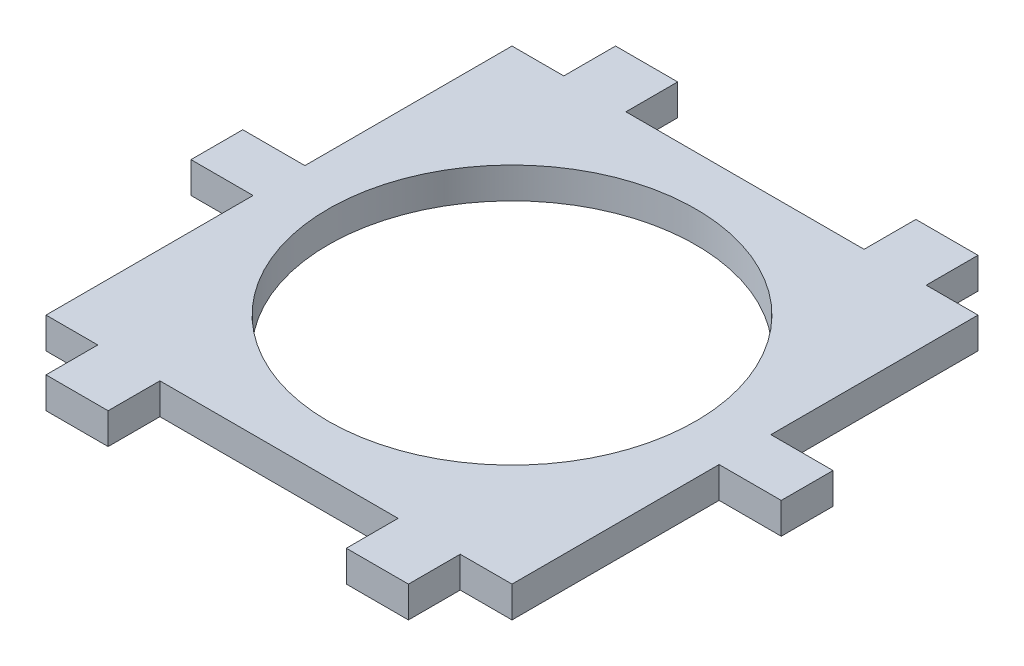
ISO-10303-21;
HEADER;
FILE_DESCRIPTION(('STEP AP214'),'2;1');
FILE_NAME('part.step','',(''),(''),'','','');
FILE_SCHEMA(('AUTOMOTIVE_DESIGN { 1 0 10303 214 1 1 1 1 }'));
ENDSEC;
DATA;
#1=APPLICATION_CONTEXT('core data for automotive mechanical design processes');
#2=APPLICATION_PROTOCOL_DEFINITION('international standard','automotive_design',2000,#1);
#3=PRODUCT_CONTEXT('',#1,'mechanical');
#4=PRODUCT('Part','Part','',(#3));
#5=PRODUCT_RELATED_PRODUCT_CATEGORY('part','',(#4));
#6=PRODUCT_DEFINITION_FORMATION('','',#4);
#7=PRODUCT_DEFINITION_CONTEXT('part definition',#1,'design');
#8=PRODUCT_DEFINITION('design','',#6,#7);
#9=PRODUCT_DEFINITION_SHAPE('','',#8);
#10=(LENGTH_UNIT() NAMED_UNIT(*) SI_UNIT(.MILLI.,.METRE.));
#11=(NAMED_UNIT(*) PLANE_ANGLE_UNIT() SI_UNIT($,.RADIAN.));
#12=(NAMED_UNIT(*) SI_UNIT($,.STERADIAN.) SOLID_ANGLE_UNIT());
#13=UNCERTAINTY_MEASURE_WITH_UNIT(LENGTH_MEASURE(1.E-05),#10,'distance_accuracy_value','');
#14=(GEOMETRIC_REPRESENTATION_CONTEXT(3) GLOBAL_UNCERTAINTY_ASSIGNED_CONTEXT((#13)) GLOBAL_UNIT_ASSIGNED_CONTEXT((#10,
#11,#12)) REPRESENTATION_CONTEXT('',''));
#15=CARTESIAN_POINT('',(0.,0.,0.));
#16=DIRECTION('',(0.,0.,1.));
#17=DIRECTION('',(1.,0.,0.));
#18=AXIS2_PLACEMENT_3D('',#15,#16,#17);
#19=CARTESIAN_POINT('',(22.5,3.,0.));
#20=DIRECTION('',(1.,0.,0.));
#21=DIRECTION('',(0.,0.,-1.));
#22=AXIS2_PLACEMENT_3D('',#19,#20,#21);
#23=PLANE('',#22);
#24=DIRECTION('',(0.,0.,1.));
#25=VECTOR('',#24,1.);
#26=CARTESIAN_POINT('',(22.5,3.,0.));
#27=LINE('',#26,#25);
#28=CARTESIAN_POINT('',(22.5,3.,-22.5));
#29=VERTEX_POINT('',#28);
#30=CARTESIAN_POINT('',(22.5,3.,-2.50000000000001));
#31=VERTEX_POINT('',#30);
#32=EDGE_CURVE('E480',#29,#31,#27,.T.);
#33=ORIENTED_EDGE('',*,*,#32,.T.);
#34=DIRECTION('',(0.,-1.,0.));
#35=VECTOR('',#34,1.);
#36=CARTESIAN_POINT('',(22.5,3.,-2.50000000000001));
#37=LINE('',#36,#35);
#38=CARTESIAN_POINT('',(22.5,0.,-2.50000000000001));
#39=VERTEX_POINT('',#38);
#40=EDGE_CURVE('E231',#31,#39,#37,.T.);
#41=ORIENTED_EDGE('',*,*,#40,.T.);
#42=DIRECTION('',(0.,0.,1.));
#43=VECTOR('',#42,1.);
#44=CARTESIAN_POINT('',(22.5,0.,0.));
#45=LINE('',#44,#43);
#46=CARTESIAN_POINT('',(22.5,0.,-22.5));
#47=VERTEX_POINT('',#46);
#48=EDGE_CURVE('E288',#47,#39,#45,.T.);
#49=ORIENTED_EDGE('',*,*,#48,.F.);
#50=DIRECTION('',(0.,-1.,0.));
#51=VECTOR('',#50,1.);
#52=CARTESIAN_POINT('',(22.5,3.,-22.5));
#53=LINE('',#52,#51);
#54=EDGE_CURVE('E11',#29,#47,#53,.T.);
#55=ORIENTED_EDGE('',*,*,#54,.F.);
#56=EDGE_LOOP('',(#33,#41,#49,#55));
#57=FACE_BOUND('',#56,.T.);
#58=ADVANCED_FACE('F37',(#57),#23,.T.);
#59=CARTESIAN_POINT('',(-22.5,3.,0.));
#60=DIRECTION('',(1.,0.,0.));
#61=DIRECTION('',(0.,0.,-1.));
#62=AXIS2_PLACEMENT_3D('',#59,#60,#61);
#63=PLANE('',#62);
#64=DIRECTION('',(0.,-1.,0.));
#65=VECTOR('',#64,1.);
#66=CARTESIAN_POINT('',(-22.5,3.,-2.50000000000001));
#67=LINE('',#66,#65);
#68=CARTESIAN_POINT('',(-22.5,3.,-2.50000000000001));
#69=VERTEX_POINT('',#68);
#70=CARTESIAN_POINT('',(-22.5,0.,-2.50000000000001));
#71=VERTEX_POINT('',#70);
#72=EDGE_CURVE('E274',#69,#71,#67,.T.);
#73=ORIENTED_EDGE('',*,*,#72,.F.);
#74=DIRECTION('',(0.,0.,1.));
#75=VECTOR('',#74,1.);
#76=CARTESIAN_POINT('',(-22.5,3.,0.));
#77=LINE('',#76,#75);
#78=CARTESIAN_POINT('',(-22.5,3.,-22.5));
#79=VERTEX_POINT('',#78);
#80=EDGE_CURVE('E431',#79,#69,#77,.T.);
#81=ORIENTED_EDGE('',*,*,#80,.F.);
#82=DIRECTION('',(0.,-1.,0.));
#83=VECTOR('',#82,1.);
#84=CARTESIAN_POINT('',(-22.5,3.,-22.5));
#85=LINE('',#84,#83);
#86=CARTESIAN_POINT('',(-22.5,0.,-22.5));
#87=VERTEX_POINT('',#86);
#88=EDGE_CURVE('E350',#79,#87,#85,.T.);
#89=ORIENTED_EDGE('',*,*,#88,.T.);
#90=DIRECTION('',(0.,0.,1.));
#91=VECTOR('',#90,1.);
#92=CARTESIAN_POINT('',(-22.5,0.,0.));
#93=LINE('',#92,#91);
#94=EDGE_CURVE('E332',#87,#71,#93,.T.);
#95=ORIENTED_EDGE('',*,*,#94,.T.);
#96=EDGE_LOOP('',(#73,#81,#89,#95));
#97=FACE_BOUND('',#96,.T.);
#98=ADVANCED_FACE('F535',(#97),#63,.F.);
#99=DIRECTION('',(0.,-1.,0.));
#100=VECTOR('',#99,1.);
#101=CARTESIAN_POINT('',(22.5,3.,2.49999999999999));
#102=LINE('',#101,#100);
#103=CARTESIAN_POINT('',(22.5,3.,2.49999999999999));
#104=VERTEX_POINT('',#103);
#105=CARTESIAN_POINT('',(22.5,0.,2.49999999999999));
#106=VERTEX_POINT('',#105);
#107=EDGE_CURVE('E254',#104,#106,#102,.T.);
#108=ORIENTED_EDGE('',*,*,#107,.F.);
#109=CARTESIAN_POINT('',(22.5,3.,22.5));
#110=VERTEX_POINT('',#109);
#111=EDGE_CURVE('E477',#104,#110,#27,.T.);
#112=ORIENTED_EDGE('',*,*,#111,.T.);
#113=DIRECTION('',(0.,-1.,0.));
#114=VECTOR('',#113,1.);
#115=CARTESIAN_POINT('',(22.5,3.,22.5));
#116=LINE('',#115,#114);
#117=CARTESIAN_POINT('',(22.5,0.,22.5));
#118=VERTEX_POINT('',#117);
#119=EDGE_CURVE('E375',#110,#118,#116,.T.);
#120=ORIENTED_EDGE('',*,*,#119,.T.);
#121=EDGE_CURVE('E293',#106,#118,#45,.T.);
#122=ORIENTED_EDGE('',*,*,#121,.F.);
#123=EDGE_LOOP('',(#108,#112,#120,#122));
#124=FACE_BOUND('',#123,.T.);
#125=ADVANCED_FACE('F532',(#124),#23,.T.);
#126=CARTESIAN_POINT('',(0.,3.,-22.5));
#127=DIRECTION('',(0.,0.,-1.));
#128=DIRECTION('',(-1.,0.,0.));
#129=AXIS2_PLACEMENT_3D('',#126,#127,#128);
#130=PLANE('',#129);
#131=DIRECTION('',(1.,0.,0.));
#132=VECTOR('',#131,1.);
#133=CARTESIAN_POINT('',(0.,0.,-22.5));
#134=LINE('',#133,#132);
#135=CARTESIAN_POINT('',(17.5,0.,-22.5));
#136=VERTEX_POINT('',#135);
#137=EDGE_CURVE('E292',#136,#47,#134,.T.);
#138=ORIENTED_EDGE('',*,*,#137,.F.);
#139=DIRECTION('',(0.,-1.,0.));
#140=VECTOR('',#139,1.);
#141=CARTESIAN_POINT('',(17.5,3.,-22.5));
#142=LINE('',#141,#140);
#143=CARTESIAN_POINT('',(17.5,3.,-22.5));
#144=VERTEX_POINT('',#143);
#145=EDGE_CURVE('E46',#144,#136,#142,.T.);
#146=ORIENTED_EDGE('',*,*,#145,.F.);
#147=DIRECTION('',(1.,0.,0.));
#148=VECTOR('',#147,1.);
#149=CARTESIAN_POINT('',(0.,3.,-22.5));
#150=LINE('',#149,#148);
#151=EDGE_CURVE('E471',#144,#29,#150,.T.);
#152=ORIENTED_EDGE('',*,*,#151,.T.);
#153=ORIENTED_EDGE('',*,*,#54,.T.);
#154=EDGE_LOOP('',(#138,#146,#152,#153));
#155=FACE_BOUND('',#154,.T.);
#156=ADVANCED_FACE('F466',(#155),#130,.T.);
#157=CARTESIAN_POINT('',(17.5,3.,0.));
#158=DIRECTION('',(-1.,0.,0.));
#159=DIRECTION('',(0.,0.,1.));
#160=AXIS2_PLACEMENT_3D('',#157,#158,#159);
#161=PLANE('',#160);
#162=DIRECTION('',(0.,0.,-1.));
#163=VECTOR('',#162,1.);
#164=CARTESIAN_POINT('',(17.5,0.,0.));
#165=LINE('',#164,#163);
#166=CARTESIAN_POINT('',(17.5,0.,-27.5));
#167=VERTEX_POINT('',#166);
#168=EDGE_CURVE('E303',#136,#167,#165,.T.);
#169=ORIENTED_EDGE('',*,*,#168,.T.);
#170=DIRECTION('',(0.,-1.,0.));
#171=VECTOR('',#170,1.);
#172=CARTESIAN_POINT('',(17.5,3.,-27.5));
#173=LINE('',#172,#171);
#174=CARTESIAN_POINT('',(17.5,3.,-27.5));
#175=VERTEX_POINT('',#174);
#176=EDGE_CURVE('E336',#175,#167,#173,.T.);
#177=ORIENTED_EDGE('',*,*,#176,.F.);
#178=DIRECTION('',(0.,0.,-1.));
#179=VECTOR('',#178,1.);
#180=CARTESIAN_POINT('',(17.5,3.,0.));
#181=LINE('',#180,#179);
#182=EDGE_CURVE('E487',#144,#175,#181,.T.);
#183=ORIENTED_EDGE('',*,*,#182,.F.);
#184=ORIENTED_EDGE('',*,*,#145,.T.);
#185=EDGE_LOOP('',(#169,#177,#183,#184));
#186=FACE_BOUND('',#185,.T.);
#187=ADVANCED_FACE('F524',(#186),#161,.F.);
#188=CARTESIAN_POINT('',(0.,3.,-27.5));
#189=DIRECTION('',(0.,0.,-1.));
#190=DIRECTION('',(-1.,0.,0.));
#191=AXIS2_PLACEMENT_3D('',#188,#189,#190);
#192=PLANE('',#191);
#193=DIRECTION('',(1.,0.,0.));
#194=VECTOR('',#193,1.);
#195=CARTESIAN_POINT('',(0.,0.,-27.5));
#196=LINE('',#195,#194);
#197=CARTESIAN_POINT('',(11.5,0.,-27.5));
#198=VERTEX_POINT('',#197);
#199=EDGE_CURVE('E308',#198,#167,#196,.T.);
#200=ORIENTED_EDGE('',*,*,#199,.F.);
#201=DIRECTION('',(0.,-1.,0.));
#202=VECTOR('',#201,1.);
#203=CARTESIAN_POINT('',(11.5,3.,-27.5));
#204=LINE('',#203,#202);
#205=CARTESIAN_POINT('',(11.5,3.,-27.5));
#206=VERTEX_POINT('',#205);
#207=EDGE_CURVE('E338',#206,#198,#204,.T.);
#208=ORIENTED_EDGE('',*,*,#207,.F.);
#209=DIRECTION('',(1.,0.,0.));
#210=VECTOR('',#209,1.);
#211=CARTESIAN_POINT('',(0.,3.,-27.5));
#212=LINE('',#211,#210);
#213=EDGE_CURVE('E490',#206,#175,#212,.T.);
#214=ORIENTED_EDGE('',*,*,#213,.T.);
#215=ORIENTED_EDGE('',*,*,#176,.T.);
#216=EDGE_LOOP('',(#200,#208,#214,#215));
#217=FACE_BOUND('',#216,.T.);
#218=ADVANCED_FACE('F460',(#217),#192,.T.);
#219=CARTESIAN_POINT('',(11.5,3.,0.));
#220=DIRECTION('',(-1.,0.,0.));
#221=DIRECTION('',(0.,0.,1.));
#222=AXIS2_PLACEMENT_3D('',#219,#220,#221);
#223=PLANE('',#222);
#224=DIRECTION('',(0.,0.,-1.));
#225=VECTOR('',#224,1.);
#226=CARTESIAN_POINT('',(11.5,0.,0.));
#227=LINE('',#226,#225);
#228=CARTESIAN_POINT('',(11.5,0.,-22.5));
#229=VERTEX_POINT('',#228);
#230=EDGE_CURVE('E311',#229,#198,#227,.T.);
#231=ORIENTED_EDGE('',*,*,#230,.F.);
#232=DIRECTION('',(0.,-1.,0.));
#233=VECTOR('',#232,1.);
#234=CARTESIAN_POINT('',(11.5,3.,-22.5));
#235=LINE('',#234,#233);
#236=CARTESIAN_POINT('',(11.5,3.,-22.5));
#237=VERTEX_POINT('',#236);
#238=EDGE_CURVE('E340',#237,#229,#235,.T.);
#239=ORIENTED_EDGE('',*,*,#238,.F.);
#240=DIRECTION('',(0.,0.,-1.));
#241=VECTOR('',#240,1.);
#242=CARTESIAN_POINT('',(11.5,3.,0.));
#243=LINE('',#242,#241);
#244=EDGE_CURVE('E456',#237,#206,#243,.T.);
#245=ORIENTED_EDGE('',*,*,#244,.T.);
#246=ORIENTED_EDGE('',*,*,#207,.T.);
#247=EDGE_LOOP('',(#231,#239,#245,#246));
#248=FACE_BOUND('',#247,.T.);
#249=ADVANCED_FACE('F454',(#248),#223,.T.);
#250=CARTESIAN_POINT('',(-11.5,0.,-22.5));
#251=VERTEX_POINT('',#250);
#252=EDGE_CURVE('E305',#251,#229,#134,.T.);
#253=ORIENTED_EDGE('',*,*,#252,.F.);
#254=DIRECTION('',(0.,-1.,0.));
#255=VECTOR('',#254,1.);
#256=CARTESIAN_POINT('',(-11.5,3.,-22.5));
#257=LINE('',#256,#255);
#258=CARTESIAN_POINT('',(-11.5,3.,-22.5));
#259=VERTEX_POINT('',#258);
#260=EDGE_CURVE('E342',#259,#251,#257,.T.);
#261=ORIENTED_EDGE('',*,*,#260,.F.);
#262=EDGE_CURVE('E450',#259,#237,#150,.T.);
#263=ORIENTED_EDGE('',*,*,#262,.T.);
#264=ORIENTED_EDGE('',*,*,#238,.T.);
#265=EDGE_LOOP('',(#253,#261,#263,#264));
#266=FACE_BOUND('',#265,.T.);
#267=ADVANCED_FACE('F446',(#266),#130,.T.);
#268=CARTESIAN_POINT('',(-11.5,3.,0.));
#269=DIRECTION('',(-1.,0.,0.));
#270=DIRECTION('',(0.,0.,1.));
#271=AXIS2_PLACEMENT_3D('',#268,#269,#270);
#272=PLANE('',#271);
#273=DIRECTION('',(0.,0.,-1.));
#274=VECTOR('',#273,1.);
#275=CARTESIAN_POINT('',(-11.5,0.,0.));
#276=LINE('',#275,#274);
#277=CARTESIAN_POINT('',(-11.5,0.,-27.5));
#278=VERTEX_POINT('',#277);
#279=EDGE_CURVE('E314',#251,#278,#276,.T.);
#280=ORIENTED_EDGE('',*,*,#279,.T.);
#281=DIRECTION('',(0.,-1.,0.));
#282=VECTOR('',#281,1.);
#283=CARTESIAN_POINT('',(-11.5,3.,-27.5));
#284=LINE('',#283,#282);
#285=CARTESIAN_POINT('',(-11.5,3.,-27.5));
#286=VERTEX_POINT('',#285);
#287=EDGE_CURVE('E344',#286,#278,#284,.T.);
#288=ORIENTED_EDGE('',*,*,#287,.F.);
#289=DIRECTION('',(0.,0.,-1.));
#290=VECTOR('',#289,1.);
#291=CARTESIAN_POINT('',(-11.5,3.,0.));
#292=LINE('',#291,#290);
#293=EDGE_CURVE('E493',#259,#286,#292,.T.);
#294=ORIENTED_EDGE('',*,*,#293,.F.);
#295=ORIENTED_EDGE('',*,*,#260,.T.);
#296=EDGE_LOOP('',(#280,#288,#294,#295));
#297=FACE_BOUND('',#296,.T.);
#298=ADVANCED_FACE('F523',(#297),#272,.F.);
#299=CARTESIAN_POINT('',(0.,3.,-27.5));
#300=DIRECTION('',(0.,0.,-1.));
#301=DIRECTION('',(-1.,0.,0.));
#302=AXIS2_PLACEMENT_3D('',#299,#300,#301);
#303=PLANE('',#302);
#304=DIRECTION('',(1.,0.,0.));
#305=VECTOR('',#304,1.);
#306=CARTESIAN_POINT('',(0.,0.,-27.5));
#307=LINE('',#306,#305);
#308=CARTESIAN_POINT('',(-17.5,0.,-27.5));
#309=VERTEX_POINT('',#308);
#310=EDGE_CURVE('E317',#309,#278,#307,.T.);
#311=ORIENTED_EDGE('',*,*,#310,.F.);
#312=DIRECTION('',(0.,-1.,0.));
#313=VECTOR('',#312,1.);
#314=CARTESIAN_POINT('',(-17.5,3.,-27.5));
#315=LINE('',#314,#313);
#316=CARTESIAN_POINT('',(-17.5,3.,-27.5));
#317=VERTEX_POINT('',#316);
#318=EDGE_CURVE('E346',#317,#309,#315,.T.);
#319=ORIENTED_EDGE('',*,*,#318,.F.);
#320=DIRECTION('',(1.,0.,0.));
#321=VECTOR('',#320,1.);
#322=CARTESIAN_POINT('',(0.,3.,-27.5));
#323=LINE('',#322,#321);
#324=EDGE_CURVE('E495',#317,#286,#323,.T.);
#325=ORIENTED_EDGE('',*,*,#324,.T.);
#326=ORIENTED_EDGE('',*,*,#287,.T.);
#327=EDGE_LOOP('',(#311,#319,#325,#326));
#328=FACE_BOUND('',#327,.T.);
#329=ADVANCED_FACE('F520',(#328),#303,.T.);
#330=CARTESIAN_POINT('',(-17.5,3.,0.));
#331=DIRECTION('',(-1.,0.,0.));
#332=DIRECTION('',(0.,0.,1.));
#333=AXIS2_PLACEMENT_3D('',#330,#331,#332);
#334=PLANE('',#333);
#335=DIRECTION('',(0.,0.,-1.));
#336=VECTOR('',#335,1.);
#337=CARTESIAN_POINT('',(-17.5,0.,0.));
#338=LINE('',#337,#336);
#339=CARTESIAN_POINT('',(-17.5,0.,-22.5));
#340=VERTEX_POINT('',#339);
#341=EDGE_CURVE('E320',#340,#309,#338,.T.);
#342=ORIENTED_EDGE('',*,*,#341,.F.);
#343=DIRECTION('',(0.,-1.,0.));
#344=VECTOR('',#343,1.);
#345=CARTESIAN_POINT('',(-17.5,3.,-22.5));
#346=LINE('',#345,#344);
#347=CARTESIAN_POINT('',(-17.5,3.,-22.5));
#348=VERTEX_POINT('',#347);
#349=EDGE_CURVE('E348',#348,#340,#346,.T.);
#350=ORIENTED_EDGE('',*,*,#349,.F.);
#351=DIRECTION('',(0.,0.,-1.));
#352=VECTOR('',#351,1.);
#353=CARTESIAN_POINT('',(-17.5,3.,0.));
#354=LINE('',#353,#352);
#355=EDGE_CURVE('E498',#348,#317,#354,.T.);
#356=ORIENTED_EDGE('',*,*,#355,.T.);
#357=ORIENTED_EDGE('',*,*,#318,.T.);
#358=EDGE_LOOP('',(#342,#350,#356,#357));
#359=FACE_BOUND('',#358,.T.);
#360=ADVANCED_FACE('F517',(#359),#334,.T.);
#361=EDGE_CURVE('E304',#87,#340,#134,.T.);
#362=ORIENTED_EDGE('',*,*,#361,.F.);
#363=ORIENTED_EDGE('',*,*,#88,.F.);
#364=EDGE_CURVE('E488',#79,#348,#150,.T.);
#365=ORIENTED_EDGE('',*,*,#364,.T.);
#366=ORIENTED_EDGE('',*,*,#349,.T.);
#367=EDGE_LOOP('',(#362,#363,#365,#366));
#368=FACE_BOUND('',#367,.T.);
#369=ADVANCED_FACE('F512',(#368),#130,.T.);
#370=CARTESIAN_POINT('',(-22.5,3.,2.49999999999999));
#371=VERTEX_POINT('',#370);
#372=CARTESIAN_POINT('',(-22.5,3.,22.5));
#373=VERTEX_POINT('',#372);
#374=EDGE_CURVE('E437',#371,#373,#77,.T.);
#375=ORIENTED_EDGE('',*,*,#374,.F.);
#376=DIRECTION('',(0.,-1.,0.));
#377=VECTOR('',#376,1.);
#378=CARTESIAN_POINT('',(-22.5,3.,2.49999999999999));
#379=LINE('',#378,#377);
#380=CARTESIAN_POINT('',(-22.5,0.,2.49999999999999));
#381=VERTEX_POINT('',#380);
#382=EDGE_CURVE('E277',#371,#381,#379,.T.);
#383=ORIENTED_EDGE('',*,*,#382,.T.);
#384=CARTESIAN_POINT('',(-22.5,0.,22.5));
#385=VERTEX_POINT('',#384);
#386=EDGE_CURVE('E329',#381,#385,#93,.T.);
#387=ORIENTED_EDGE('',*,*,#386,.T.);
#388=DIRECTION('',(0.,-1.,0.));
#389=VECTOR('',#388,1.);
#390=CARTESIAN_POINT('',(-22.5,3.,22.5));
#391=LINE('',#390,#389);
#392=EDGE_CURVE('E352',#373,#385,#391,.T.);
#393=ORIENTED_EDGE('',*,*,#392,.F.);
#394=EDGE_LOOP('',(#375,#383,#387,#393));
#395=FACE_BOUND('',#394,.T.);
#396=ADVANCED_FACE('F436',(#395),#63,.F.);
#397=CARTESIAN_POINT('',(0.,3.,22.5));
#398=DIRECTION('',(0.,0.,-1.));
#399=DIRECTION('',(-1.,0.,0.));
#400=AXIS2_PLACEMENT_3D('',#397,#398,#399);
#401=PLANE('',#400);
#402=DIRECTION('',(1.,0.,0.));
#403=VECTOR('',#402,1.);
#404=CARTESIAN_POINT('',(0.,0.,22.5));
#405=LINE('',#404,#403);
#406=CARTESIAN_POINT('',(-17.5,0.,22.5));
#407=VERTEX_POINT('',#406);
#408=EDGE_CURVE('E325',#385,#407,#405,.T.);
#409=ORIENTED_EDGE('',*,*,#408,.T.);
#410=DIRECTION('',(0.,-1.,0.));
#411=VECTOR('',#410,1.);
#412=CARTESIAN_POINT('',(-17.5,3.,22.5));
#413=LINE('',#412,#411);
#414=CARTESIAN_POINT('',(-17.5,3.,22.5));
#415=VERTEX_POINT('',#414);
#416=EDGE_CURVE('E355',#415,#407,#413,.T.);
#417=ORIENTED_EDGE('',*,*,#416,.F.);
#418=DIRECTION('',(1.,0.,0.));
#419=VECTOR('',#418,1.);
#420=CARTESIAN_POINT('',(0.,3.,22.5));
#421=LINE('',#420,#419);
#422=EDGE_CURVE('E429',#373,#415,#421,.T.);
#423=ORIENTED_EDGE('',*,*,#422,.F.);
#424=ORIENTED_EDGE('',*,*,#392,.T.);
#425=EDGE_LOOP('',(#409,#417,#423,#424));
#426=FACE_BOUND('',#425,.T.);
#427=ADVANCED_FACE('F428',(#426),#401,.F.);
#428=CARTESIAN_POINT('',(-17.5,3.,0.));
#429=DIRECTION('',(1.,0.,0.));
#430=DIRECTION('',(0.,0.,-1.));
#431=AXIS2_PLACEMENT_3D('',#428,#429,#430);
#432=PLANE('',#431);
#433=DIRECTION('',(0.,0.,1.));
#434=VECTOR('',#433,1.);
#435=CARTESIAN_POINT('',(-17.5,0.,0.));
#436=LINE('',#435,#434);
#437=CARTESIAN_POINT('',(-17.5,0.,27.5));
#438=VERTEX_POINT('',#437);
#439=EDGE_CURVE('E395',#407,#438,#436,.T.);
#440=ORIENTED_EDGE('',*,*,#439,.T.);
#441=DIRECTION('',(0.,-1.,0.));
#442=VECTOR('',#441,1.);
#443=CARTESIAN_POINT('',(-17.5,3.,27.5));
#444=LINE('',#443,#442);
#445=CARTESIAN_POINT('',(-17.5,3.,27.5));
#446=VERTEX_POINT('',#445);
#447=EDGE_CURVE('E358',#446,#438,#444,.T.);
#448=ORIENTED_EDGE('',*,*,#447,.F.);
#449=DIRECTION('',(0.,0.,1.));
#450=VECTOR('',#449,1.);
#451=CARTESIAN_POINT('',(-17.5,3.,0.));
#452=LINE('',#451,#450);
#453=EDGE_CURVE('E425',#415,#446,#452,.T.);
#454=ORIENTED_EDGE('',*,*,#453,.F.);
#455=ORIENTED_EDGE('',*,*,#416,.T.);
#456=EDGE_LOOP('',(#440,#448,#454,#455));
#457=FACE_BOUND('',#456,.T.);
#458=ADVANCED_FACE('F423',(#457),#432,.F.);
#459=CARTESIAN_POINT('',(0.,3.,27.5));
#460=DIRECTION('',(0.,0.,-1.));
#461=DIRECTION('',(-1.,0.,0.));
#462=AXIS2_PLACEMENT_3D('',#459,#460,#461);
#463=PLANE('',#462);
#464=DIRECTION('',(1.,0.,0.));
#465=VECTOR('',#464,1.);
#466=CARTESIAN_POINT('',(0.,0.,27.5));
#467=LINE('',#466,#465);
#468=CARTESIAN_POINT('',(-11.5,0.,27.5));
#469=VERTEX_POINT('',#468);
#470=EDGE_CURVE('E393',#438,#469,#467,.T.);
#471=ORIENTED_EDGE('',*,*,#470,.T.);
#472=DIRECTION('',(0.,-1.,0.));
#473=VECTOR('',#472,1.);
#474=CARTESIAN_POINT('',(-11.5,3.,27.5));
#475=LINE('',#474,#473);
#476=CARTESIAN_POINT('',(-11.5,3.,27.5));
#477=VERTEX_POINT('',#476);
#478=EDGE_CURVE('E361',#477,#469,#475,.T.);
#479=ORIENTED_EDGE('',*,*,#478,.F.);
#480=DIRECTION('',(1.,0.,0.));
#481=VECTOR('',#480,1.);
#482=CARTESIAN_POINT('',(0.,3.,27.5));
#483=LINE('',#482,#481);
#484=EDGE_CURVE('E571',#446,#477,#483,.T.);
#485=ORIENTED_EDGE('',*,*,#484,.F.);
#486=ORIENTED_EDGE('',*,*,#447,.T.);
#487=EDGE_LOOP('',(#471,#479,#485,#486));
#488=FACE_BOUND('',#487,.T.);
#489=ADVANCED_FACE('F421',(#488),#463,.F.);
#490=CARTESIAN_POINT('',(-11.5,3.,0.));
#491=DIRECTION('',(1.,0.,0.));
#492=DIRECTION('',(0.,0.,-1.));
#493=AXIS2_PLACEMENT_3D('',#490,#491,#492);
#494=PLANE('',#493);
#495=DIRECTION('',(0.,0.,1.));
#496=VECTOR('',#495,1.);
#497=CARTESIAN_POINT('',(-11.5,0.,0.));
#498=LINE('',#497,#496);
#499=CARTESIAN_POINT('',(-11.5,0.,22.5));
#500=VERTEX_POINT('',#499);
#501=EDGE_CURVE('E390',#500,#469,#498,.T.);
#502=ORIENTED_EDGE('',*,*,#501,.F.);
#503=DIRECTION('',(0.,-1.,0.));
#504=VECTOR('',#503,1.);
#505=CARTESIAN_POINT('',(-11.5,3.,22.5));
#506=LINE('',#505,#504);
#507=CARTESIAN_POINT('',(-11.5,3.,22.5));
#508=VERTEX_POINT('',#507);
#509=EDGE_CURVE('E363',#508,#500,#506,.T.);
#510=ORIENTED_EDGE('',*,*,#509,.F.);
#511=DIRECTION('',(0.,0.,1.));
#512=VECTOR('',#511,1.);
#513=CARTESIAN_POINT('',(-11.5,3.,0.));
#514=LINE('',#513,#512);
#515=EDGE_CURVE('E419',#508,#477,#514,.T.);
#516=ORIENTED_EDGE('',*,*,#515,.T.);
#517=ORIENTED_EDGE('',*,*,#478,.T.);
#518=EDGE_LOOP('',(#502,#510,#516,#517));
#519=FACE_BOUND('',#518,.T.);
#520=ADVANCED_FACE('F415',(#519),#494,.T.);
#521=CARTESIAN_POINT('',(11.5,0.,22.5));
#522=VERTEX_POINT('',#521);
#523=EDGE_CURVE('E389',#500,#522,#405,.T.);
#524=ORIENTED_EDGE('',*,*,#523,.T.);
#525=DIRECTION('',(0.,-1.,0.));
#526=VECTOR('',#525,1.);
#527=CARTESIAN_POINT('',(11.5,3.,22.5));
#528=LINE('',#527,#526);
#529=CARTESIAN_POINT('',(11.5,3.,22.5));
#530=VERTEX_POINT('',#529);
#531=EDGE_CURVE('E365',#530,#522,#528,.T.);
#532=ORIENTED_EDGE('',*,*,#531,.F.);
#533=EDGE_CURVE('E433',#508,#530,#421,.T.);
#534=ORIENTED_EDGE('',*,*,#533,.F.);
#535=ORIENTED_EDGE('',*,*,#509,.T.);
#536=EDGE_LOOP('',(#524,#532,#534,#535));
#537=FACE_BOUND('',#536,.T.);
#538=ADVANCED_FACE('F409',(#537),#401,.F.);
#539=CARTESIAN_POINT('',(11.5,3.,0.));
#540=DIRECTION('',(1.,0.,0.));
#541=DIRECTION('',(0.,0.,-1.));
#542=AXIS2_PLACEMENT_3D('',#539,#540,#541);
#543=PLANE('',#542);
#544=DIRECTION('',(0.,0.,1.));
#545=VECTOR('',#544,1.);
#546=CARTESIAN_POINT('',(11.5,0.,0.));
#547=LINE('',#546,#545);
#548=CARTESIAN_POINT('',(11.5,0.,27.5));
#549=VERTEX_POINT('',#548);
#550=EDGE_CURVE('E386',#522,#549,#547,.T.);
#551=ORIENTED_EDGE('',*,*,#550,.T.);
#552=DIRECTION('',(0.,-1.,0.));
#553=VECTOR('',#552,1.);
#554=CARTESIAN_POINT('',(11.5,3.,27.5));
#555=LINE('',#554,#553);
#556=CARTESIAN_POINT('',(11.5,3.,27.5));
#557=VERTEX_POINT('',#556);
#558=EDGE_CURVE('E368',#557,#549,#555,.T.);
#559=ORIENTED_EDGE('',*,*,#558,.F.);
#560=DIRECTION('',(0.,0.,1.));
#561=VECTOR('',#560,1.);
#562=CARTESIAN_POINT('',(11.5,3.,0.));
#563=LINE('',#562,#561);
#564=EDGE_CURVE('E568',#530,#557,#563,.T.);
#565=ORIENTED_EDGE('',*,*,#564,.F.);
#566=ORIENTED_EDGE('',*,*,#531,.T.);
#567=EDGE_LOOP('',(#551,#559,#565,#566));
#568=FACE_BOUND('',#567,.T.);
#569=ADVANCED_FACE('F567',(#568),#543,.F.);
#570=CARTESIAN_POINT('',(0.,3.,27.5));
#571=DIRECTION('',(0.,0.,-1.));
#572=DIRECTION('',(-1.,0.,0.));
#573=AXIS2_PLACEMENT_3D('',#570,#571,#572);
#574=PLANE('',#573);
#575=DIRECTION('',(1.,0.,0.));
#576=VECTOR('',#575,1.);
#577=CARTESIAN_POINT('',(0.,0.,27.5));
#578=LINE('',#577,#576);
#579=CARTESIAN_POINT('',(17.5,0.,27.5));
#580=VERTEX_POINT('',#579);
#581=EDGE_CURVE('E383',#549,#580,#578,.T.);
#582=ORIENTED_EDGE('',*,*,#581,.T.);
#583=DIRECTION('',(0.,-1.,0.));
#584=VECTOR('',#583,1.);
#585=CARTESIAN_POINT('',(17.5,3.,27.5));
#586=LINE('',#585,#584);
#587=CARTESIAN_POINT('',(17.5,3.,27.5));
#588=VERTEX_POINT('',#587);
#589=EDGE_CURVE('E371',#588,#580,#586,.T.);
#590=ORIENTED_EDGE('',*,*,#589,.F.);
#591=DIRECTION('',(1.,0.,0.));
#592=VECTOR('',#591,1.);
#593=CARTESIAN_POINT('',(0.,3.,27.5));
#594=LINE('',#593,#592);
#595=EDGE_CURVE('E564',#557,#588,#594,.T.);
#596=ORIENTED_EDGE('',*,*,#595,.F.);
#597=ORIENTED_EDGE('',*,*,#558,.T.);
#598=EDGE_LOOP('',(#582,#590,#596,#597));
#599=FACE_BOUND('',#598,.T.);
#600=ADVANCED_FACE('F562',(#599),#574,.F.);
#601=CARTESIAN_POINT('',(17.5,3.,0.));
#602=DIRECTION('',(1.,0.,0.));
#603=DIRECTION('',(0.,0.,-1.));
#604=AXIS2_PLACEMENT_3D('',#601,#602,#603);
#605=PLANE('',#604);
#606=DIRECTION('',(0.,0.,1.));
#607=VECTOR('',#606,1.);
#608=CARTESIAN_POINT('',(17.5,0.,0.));
#609=LINE('',#608,#607);
#610=CARTESIAN_POINT('',(17.5,0.,22.5));
#611=VERTEX_POINT('',#610);
#612=EDGE_CURVE('E379',#611,#580,#609,.T.);
#613=ORIENTED_EDGE('',*,*,#612,.F.);
#614=DIRECTION('',(0.,-1.,0.));
#615=VECTOR('',#614,1.);
#616=CARTESIAN_POINT('',(17.5,3.,22.5));
#617=LINE('',#616,#615);
#618=CARTESIAN_POINT('',(17.5,3.,22.5));
#619=VERTEX_POINT('',#618);
#620=EDGE_CURVE('E373',#619,#611,#617,.T.);
#621=ORIENTED_EDGE('',*,*,#620,.F.);
#622=DIRECTION('',(0.,0.,1.));
#623=VECTOR('',#622,1.);
#624=CARTESIAN_POINT('',(17.5,3.,0.));
#625=LINE('',#624,#623);
#626=EDGE_CURVE('E553',#619,#588,#625,.T.);
#627=ORIENTED_EDGE('',*,*,#626,.T.);
#628=ORIENTED_EDGE('',*,*,#589,.T.);
#629=EDGE_LOOP('',(#613,#621,#627,#628));
#630=FACE_BOUND('',#629,.T.);
#631=ADVANCED_FACE('F559',(#630),#605,.T.);
#632=CARTESIAN_POINT('',(0.,3.,0.));
#633=DIRECTION('',(0.,-1.,0.));
#634=DIRECTION('',(0.,0.,-1.));
#635=AXIS2_PLACEMENT_3D('',#632,#633,#634);
#636=CYLINDRICAL_SURFACE('',#635,17.75);
#637=CARTESIAN_POINT('',(0.,3.,0.));
#638=DIRECTION('',(0.,1.,0.));
#639=DIRECTION('',(0.,0.,1.));
#640=AXIS2_PLACEMENT_3D('',#637,#638,#639);
#641=CIRCLE('',#640,17.75);
#642=CARTESIAN_POINT('',(0.,3.,17.75));
#643=VERTEX_POINT('',#642);
#644=EDGE_CURVE('E404',#643,#643,#641,.T.);
#645=ORIENTED_EDGE('',*,*,#644,.T.);
#646=EDGE_LOOP('',(#645));
#647=FACE_BOUND('',#646,.T.);
#648=CARTESIAN_POINT('',(0.,0.,0.));
#649=DIRECTION('',(0.,1.,0.));
#650=DIRECTION('',(0.,0.,1.));
#651=AXIS2_PLACEMENT_3D('',#648,#649,#650);
#652=CIRCLE('',#651,17.75);
#653=CARTESIAN_POINT('',(0.,0.,17.75));
#654=VERTEX_POINT('',#653);
#655=EDGE_CURVE('E298',#654,#654,#652,.T.);
#656=ORIENTED_EDGE('',*,*,#655,.F.);
#657=EDGE_LOOP('',(#656));
#658=FACE_BOUND('',#657,.T.);
#659=ADVANCED_FACE('F39',(#647,#658),#636,.F.);
#660=EDGE_CURVE('E382',#611,#118,#405,.T.);
#661=ORIENTED_EDGE('',*,*,#660,.T.);
#662=ORIENTED_EDGE('',*,*,#119,.F.);
#663=EDGE_CURVE('E378',#619,#110,#421,.T.);
#664=ORIENTED_EDGE('',*,*,#663,.F.);
#665=ORIENTED_EDGE('',*,*,#620,.T.);
#666=EDGE_LOOP('',(#661,#662,#664,#665));
#667=FACE_BOUND('',#666,.T.);
#668=ADVANCED_FACE('F555',(#667),#401,.F.);
#669=CARTESIAN_POINT('',(0.,3.,0.));
#670=DIRECTION('',(0.,1.,0.));
#671=DIRECTION('',(0.,0.,1.));
#672=AXIS2_PLACEMENT_3D('',#669,#670,#671);
#673=PLANE('',#672);
#674=ORIENTED_EDGE('',*,*,#644,.F.);
#675=EDGE_LOOP('',(#674));
#676=FACE_BOUND('',#675,.T.);
#677=ORIENTED_EDGE('',*,*,#32,.F.);
#678=ORIENTED_EDGE('',*,*,#151,.F.);
#679=ORIENTED_EDGE('',*,*,#182,.T.);
#680=ORIENTED_EDGE('',*,*,#213,.F.);
#681=ORIENTED_EDGE('',*,*,#244,.F.);
#682=ORIENTED_EDGE('',*,*,#262,.F.);
#683=ORIENTED_EDGE('',*,*,#293,.T.);
#684=ORIENTED_EDGE('',*,*,#324,.F.);
#685=ORIENTED_EDGE('',*,*,#355,.F.);
#686=ORIENTED_EDGE('',*,*,#364,.F.);
#687=ORIENTED_EDGE('',*,*,#80,.T.);
#688=DIRECTION('',(-1.,0.,0.));
#689=VECTOR('',#688,1.);
#690=CARTESIAN_POINT('',(0.,3.,-2.50000000000001));
#691=LINE('',#690,#689);
#692=CARTESIAN_POINT('',(-28.5,3.,-2.50000000000001));
#693=VERTEX_POINT('',#692);
#694=EDGE_CURVE('E265',#69,#693,#691,.T.);
#695=ORIENTED_EDGE('',*,*,#694,.T.);
#696=DIRECTION('',(0.,0.,1.));
#697=VECTOR('',#696,1.);
#698=CARTESIAN_POINT('',(-28.5,3.,0.));
#699=LINE('',#698,#697);
#700=CARTESIAN_POINT('',(-28.5,3.,2.49999999999999));
#701=VERTEX_POINT('',#700);
#702=EDGE_CURVE('E262',#693,#701,#699,.T.);
#703=ORIENTED_EDGE('',*,*,#702,.T.);
#704=DIRECTION('',(-1.,0.,0.));
#705=VECTOR('',#704,1.);
#706=CARTESIAN_POINT('',(0.,3.,2.49999999999999));
#707=LINE('',#706,#705);
#708=EDGE_CURVE('E264',#371,#701,#707,.T.);
#709=ORIENTED_EDGE('',*,*,#708,.F.);
#710=ORIENTED_EDGE('',*,*,#374,.T.);
#711=ORIENTED_EDGE('',*,*,#422,.T.);
#712=ORIENTED_EDGE('',*,*,#453,.T.);
#713=ORIENTED_EDGE('',*,*,#484,.T.);
#714=ORIENTED_EDGE('',*,*,#515,.F.);
#715=ORIENTED_EDGE('',*,*,#533,.T.);
#716=ORIENTED_EDGE('',*,*,#564,.T.);
#717=ORIENTED_EDGE('',*,*,#595,.T.);
#718=ORIENTED_EDGE('',*,*,#626,.F.);
#719=ORIENTED_EDGE('',*,*,#663,.T.);
#720=ORIENTED_EDGE('',*,*,#111,.F.);
#721=DIRECTION('',(1.,0.,0.));
#722=VECTOR('',#721,1.);
#723=CARTESIAN_POINT('',(0.,3.,2.5));
#724=LINE('',#723,#722);
#725=CARTESIAN_POINT('',(28.5,3.,2.49999999999999));
#726=VERTEX_POINT('',#725);
#727=EDGE_CURVE('E240',#104,#726,#724,.T.);
#728=ORIENTED_EDGE('',*,*,#727,.T.);
#729=DIRECTION('',(0.,0.,1.));
#730=VECTOR('',#729,1.);
#731=CARTESIAN_POINT('',(28.5,3.,0.));
#732=LINE('',#731,#730);
#733=CARTESIAN_POINT('',(28.5,3.,-2.50000000000001));
#734=VERTEX_POINT('',#733);
#735=EDGE_CURVE('E226',#734,#726,#732,.T.);
#736=ORIENTED_EDGE('',*,*,#735,.F.);
#737=DIRECTION('',(1.,0.,0.));
#738=VECTOR('',#737,1.);
#739=CARTESIAN_POINT('',(0.,3.,-2.50000000000001));
#740=LINE('',#739,#738);
#741=EDGE_CURVE('E237',#31,#734,#740,.T.);
#742=ORIENTED_EDGE('',*,*,#741,.F.);
#743=EDGE_LOOP('',(#677,#678,#679,#680,#681,#682,#683,#684,#685,#686,#687,#695,#703,#709,#710,
#711,#712,#713,#714,#715,#716,#717,#718,#719,#720,#728,#736,#742));
#744=FACE_BOUND('',#743,.T.);
#745=ADVANCED_FACE('F236',(#676,#744),#673,.T.);
#746=CARTESIAN_POINT('',(0.,0.,0.));
#747=DIRECTION('',(0.,1.,0.));
#748=DIRECTION('',(0.,0.,1.));
#749=AXIS2_PLACEMENT_3D('',#746,#747,#748);
#750=PLANE('',#749);
#751=ORIENTED_EDGE('',*,*,#655,.T.);
#752=EDGE_LOOP('',(#751));
#753=FACE_BOUND('',#752,.T.);
#754=ORIENTED_EDGE('',*,*,#48,.T.);
#755=DIRECTION('',(1.,0.,0.));
#756=VECTOR('',#755,1.);
#757=CARTESIAN_POINT('',(0.,0.,-2.50000000000001));
#758=LINE('',#757,#756);
#759=CARTESIAN_POINT('',(28.5,0.,-2.50000000000001));
#760=VERTEX_POINT('',#759);
#761=EDGE_CURVE('E54',#39,#760,#758,.T.);
#762=ORIENTED_EDGE('',*,*,#761,.T.);
#763=DIRECTION('',(0.,0.,1.));
#764=VECTOR('',#763,1.);
#765=CARTESIAN_POINT('',(28.5,0.,0.));
#766=LINE('',#765,#764);
#767=CARTESIAN_POINT('',(28.5,0.,2.49999999999999));
#768=VERTEX_POINT('',#767);
#769=EDGE_CURVE('E228',#760,#768,#766,.T.);
#770=ORIENTED_EDGE('',*,*,#769,.T.);
#771=DIRECTION('',(1.,0.,0.));
#772=VECTOR('',#771,1.);
#773=CARTESIAN_POINT('',(0.,0.,2.5));
#774=LINE('',#773,#772);
#775=EDGE_CURVE('E242',#106,#768,#774,.T.);
#776=ORIENTED_EDGE('',*,*,#775,.F.);
#777=ORIENTED_EDGE('',*,*,#121,.T.);
#778=ORIENTED_EDGE('',*,*,#660,.F.);
#779=ORIENTED_EDGE('',*,*,#612,.T.);
#780=ORIENTED_EDGE('',*,*,#581,.F.);
#781=ORIENTED_EDGE('',*,*,#550,.F.);
#782=ORIENTED_EDGE('',*,*,#523,.F.);
#783=ORIENTED_EDGE('',*,*,#501,.T.);
#784=ORIENTED_EDGE('',*,*,#470,.F.);
#785=ORIENTED_EDGE('',*,*,#439,.F.);
#786=ORIENTED_EDGE('',*,*,#408,.F.);
#787=ORIENTED_EDGE('',*,*,#386,.F.);
#788=DIRECTION('',(-1.,0.,0.));
#789=VECTOR('',#788,1.);
#790=CARTESIAN_POINT('',(0.,0.,2.49999999999999));
#791=LINE('',#790,#789);
#792=CARTESIAN_POINT('',(-28.5,0.,2.49999999999999));
#793=VERTEX_POINT('',#792);
#794=EDGE_CURVE('E62',#381,#793,#791,.T.);
#795=ORIENTED_EDGE('',*,*,#794,.T.);
#796=DIRECTION('',(0.,0.,1.));
#797=VECTOR('',#796,1.);
#798=CARTESIAN_POINT('',(-28.5,0.,0.));
#799=LINE('',#798,#797);
#800=CARTESIAN_POINT('',(-28.5,0.,-2.50000000000001));
#801=VERTEX_POINT('',#800);
#802=EDGE_CURVE('E266',#801,#793,#799,.T.);
#803=ORIENTED_EDGE('',*,*,#802,.F.);
#804=DIRECTION('',(-1.,0.,0.));
#805=VECTOR('',#804,1.);
#806=CARTESIAN_POINT('',(0.,0.,-2.50000000000001));
#807=LINE('',#806,#805);
#808=EDGE_CURVE('E230',#71,#801,#807,.T.);
#809=ORIENTED_EDGE('',*,*,#808,.F.);
#810=ORIENTED_EDGE('',*,*,#94,.F.);
#811=ORIENTED_EDGE('',*,*,#361,.T.);
#812=ORIENTED_EDGE('',*,*,#341,.T.);
#813=ORIENTED_EDGE('',*,*,#310,.T.);
#814=ORIENTED_EDGE('',*,*,#279,.F.);
#815=ORIENTED_EDGE('',*,*,#252,.T.);
#816=ORIENTED_EDGE('',*,*,#230,.T.);
#817=ORIENTED_EDGE('',*,*,#199,.T.);
#818=ORIENTED_EDGE('',*,*,#168,.F.);
#819=ORIENTED_EDGE('',*,*,#137,.T.);
#820=EDGE_LOOP('',(#754,#762,#770,#776,#777,#778,#779,#780,#781,#782,#783,#784,#785,#786,#787,
#795,#803,#809,#810,#811,#812,#813,#814,#815,#816,#817,#818,#819));
#821=FACE_BOUND('',#820,.T.);
#822=ADVANCED_FACE('F413',(#753,#821),#750,.F.);
#823=CARTESIAN_POINT('',(0.,3.,-2.50000000000001));
#824=DIRECTION('',(0.,0.,1.));
#825=DIRECTION('',(1.,0.,0.));
#826=AXIS2_PLACEMENT_3D('',#823,#824,#825);
#827=PLANE('',#826);
#828=ORIENTED_EDGE('',*,*,#808,.T.);
#829=DIRECTION('',(0.,-1.,0.));
#830=VECTOR('',#829,1.);
#831=CARTESIAN_POINT('',(-28.5,3.,-2.50000000000001));
#832=LINE('',#831,#830);
#833=EDGE_CURVE('E872',#693,#801,#832,.T.);
#834=ORIENTED_EDGE('',*,*,#833,.F.);
#835=ORIENTED_EDGE('',*,*,#694,.F.);
#836=ORIENTED_EDGE('',*,*,#72,.T.);
#837=EDGE_LOOP('',(#828,#834,#835,#836));
#838=FACE_BOUND('',#837,.T.);
#839=ADVANCED_FACE('F790',(#838),#827,.F.);
#840=CARTESIAN_POINT('',(-28.5,3.,0.));
#841=DIRECTION('',(1.,0.,0.));
#842=DIRECTION('',(0.,0.,-1.));
#843=AXIS2_PLACEMENT_3D('',#840,#841,#842);
#844=PLANE('',#843);
#845=ORIENTED_EDGE('',*,*,#802,.T.);
#846=DIRECTION('',(0.,-1.,0.));
#847=VECTOR('',#846,1.);
#848=CARTESIAN_POINT('',(-28.5,3.,2.49999999999999));
#849=LINE('',#848,#847);
#850=EDGE_CURVE('E869',#701,#793,#849,.T.);
#851=ORIENTED_EDGE('',*,*,#850,.F.);
#852=ORIENTED_EDGE('',*,*,#702,.F.);
#853=ORIENTED_EDGE('',*,*,#833,.T.);
#854=EDGE_LOOP('',(#845,#851,#852,#853));
#855=FACE_BOUND('',#854,.T.);
#856=ADVANCED_FACE('F819',(#855),#844,.F.);
#857=CARTESIAN_POINT('',(0.,3.,2.49999999999999));
#858=DIRECTION('',(0.,0.,1.));
#859=DIRECTION('',(1.,0.,0.));
#860=AXIS2_PLACEMENT_3D('',#857,#858,#859);
#861=PLANE('',#860);
#862=ORIENTED_EDGE('',*,*,#794,.F.);
#863=ORIENTED_EDGE('',*,*,#382,.F.);
#864=ORIENTED_EDGE('',*,*,#708,.T.);
#865=ORIENTED_EDGE('',*,*,#850,.T.);
#866=EDGE_LOOP('',(#862,#863,#864,#865));
#867=FACE_BOUND('',#866,.T.);
#868=ADVANCED_FACE('F829',(#867),#861,.T.);
#869=CARTESIAN_POINT('',(28.5,3.,0.));
#870=DIRECTION('',(1.,0.,0.));
#871=DIRECTION('',(0.,0.,-1.));
#872=AXIS2_PLACEMENT_3D('',#869,#870,#871);
#873=PLANE('',#872);
#874=ORIENTED_EDGE('',*,*,#769,.F.);
#875=DIRECTION('',(0.,-1.,0.));
#876=VECTOR('',#875,1.);
#877=CARTESIAN_POINT('',(28.5,3.,-2.50000000000001));
#878=LINE('',#877,#876);
#879=EDGE_CURVE('E223',#734,#760,#878,.T.);
#880=ORIENTED_EDGE('',*,*,#879,.F.);
#881=ORIENTED_EDGE('',*,*,#735,.T.);
#882=DIRECTION('',(0.,-1.,0.));
#883=VECTOR('',#882,1.);
#884=CARTESIAN_POINT('',(28.5,3.,2.49999999999999));
#885=LINE('',#884,#883);
#886=EDGE_CURVE('E246',#726,#768,#885,.T.);
#887=ORIENTED_EDGE('',*,*,#886,.T.);
#888=EDGE_LOOP('',(#874,#880,#881,#887));
#889=FACE_BOUND('',#888,.T.);
#890=ADVANCED_FACE('F225',(#889),#873,.T.);
#891=CARTESIAN_POINT('',(0.,3.,-2.50000000000001));
#892=DIRECTION('',(0.,0.,-1.));
#893=DIRECTION('',(-1.,0.,0.));
#894=AXIS2_PLACEMENT_3D('',#891,#892,#893);
#895=PLANE('',#894);
#896=ORIENTED_EDGE('',*,*,#761,.F.);
#897=ORIENTED_EDGE('',*,*,#40,.F.);
#898=ORIENTED_EDGE('',*,*,#741,.T.);
#899=ORIENTED_EDGE('',*,*,#879,.T.);
#900=EDGE_LOOP('',(#896,#897,#898,#899));
#901=FACE_BOUND('',#900,.T.);
#902=ADVANCED_FACE('F244',(#901),#895,.T.);
#903=CARTESIAN_POINT('',(0.,3.,2.5));
#904=DIRECTION('',(0.,0.,-1.));
#905=DIRECTION('',(-1.,0.,0.));
#906=AXIS2_PLACEMENT_3D('',#903,#904,#905);
#907=PLANE('',#906);
#908=ORIENTED_EDGE('',*,*,#775,.T.);
#909=ORIENTED_EDGE('',*,*,#886,.F.);
#910=ORIENTED_EDGE('',*,*,#727,.F.);
#911=ORIENTED_EDGE('',*,*,#107,.T.);
#912=EDGE_LOOP('',(#908,#909,#910,#911));
#913=FACE_BOUND('',#912,.T.);
#914=ADVANCED_FACE('F855',(#913),#907,.F.);
#915=CLOSED_SHELL('',(#58,#98,#125,#156,#187,#218,#249,#267,#298,#329,#360,#369,#396,#427,#458,
#489,#520,#538,#569,#600,#631,#659,#668,#745,#822,#839,#856,#868,#890,#902,#914));
#916=MANIFOLD_SOLID_BREP('B2',#915);
#917=ADVANCED_BREP_SHAPE_REPRESENTATION('',(#18,#916),#14);
#918=SHAPE_DEFINITION_REPRESENTATION(#9,#917);
ENDSEC;
END-ISO-10303-21;
